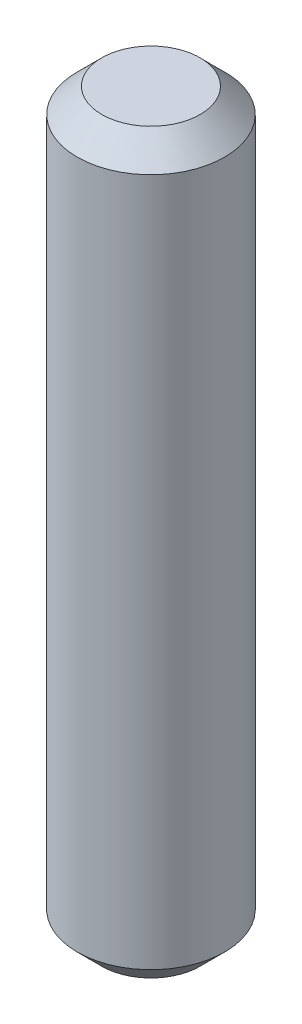
ISO-10303-21;
HEADER;
FILE_DESCRIPTION(('STEP AP214'),'2;1');
FILE_NAME('part.step','',(''),(''),'','','');
FILE_SCHEMA(('AUTOMOTIVE_DESIGN { 1 0 10303 214 1 1 1 1 }'));
ENDSEC;
DATA;
#1=APPLICATION_CONTEXT('core data for automotive mechanical design processes');
#2=APPLICATION_PROTOCOL_DEFINITION('international standard','automotive_design',2000,#1);
#3=PRODUCT_CONTEXT('',#1,'mechanical');
#4=PRODUCT('Part','Part','',(#3));
#5=PRODUCT_RELATED_PRODUCT_CATEGORY('part','',(#4));
#6=PRODUCT_DEFINITION_FORMATION('','',#4);
#7=PRODUCT_DEFINITION_CONTEXT('part definition',#1,'design');
#8=PRODUCT_DEFINITION('design','',#6,#7);
#9=PRODUCT_DEFINITION_SHAPE('','',#8);
#10=(LENGTH_UNIT() NAMED_UNIT(*) SI_UNIT(.MILLI.,.METRE.));
#11=(NAMED_UNIT(*) PLANE_ANGLE_UNIT() SI_UNIT($,.RADIAN.));
#12=(NAMED_UNIT(*) SI_UNIT($,.STERADIAN.) SOLID_ANGLE_UNIT());
#13=UNCERTAINTY_MEASURE_WITH_UNIT(LENGTH_MEASURE(1.E-05),#10,'distance_accuracy_value','');
#14=(GEOMETRIC_REPRESENTATION_CONTEXT(3) GLOBAL_UNCERTAINTY_ASSIGNED_CONTEXT((#13)) GLOBAL_UNIT_ASSIGNED_CONTEXT((#10,
#11,#12)) REPRESENTATION_CONTEXT('',''));
#15=CARTESIAN_POINT('',(0.,0.,0.));
#16=DIRECTION('',(0.,0.,1.));
#17=DIRECTION('',(1.,0.,0.));
#18=AXIS2_PLACEMENT_3D('',#15,#16,#17);
#19=CARTESIAN_POINT('',(0.,30.,0.));
#20=DIRECTION('',(0.,-1.,0.));
#21=DIRECTION('',(0.,0.,-1.));
#22=AXIS2_PLACEMENT_3D('',#19,#20,#21);
#23=CYLINDRICAL_SURFACE('',#22,3.);
#24=CARTESIAN_POINT('',(0.,0.999999999999997,0.));
#25=DIRECTION('',(0.,1.,0.));
#26=DIRECTION('',(0.,0.,1.));
#27=AXIS2_PLACEMENT_3D('',#24,#25,#26);
#28=CIRCLE('',#27,3.);
#29=CARTESIAN_POINT('',(0.,0.999999999999997,3.));
#30=VERTEX_POINT('',#29);
#31=EDGE_CURVE('E40',#30,#30,#28,.T.);
#32=ORIENTED_EDGE('',*,*,#31,.T.);
#33=EDGE_LOOP('',(#32));
#34=FACE_BOUND('',#33,.T.);
#35=CARTESIAN_POINT('',(0.,29.,0.));
#36=DIRECTION('',(0.,1.,0.));
#37=DIRECTION('',(0.,0.,1.));
#38=AXIS2_PLACEMENT_3D('',#35,#36,#37);
#39=CIRCLE('',#38,3.);
#40=CARTESIAN_POINT('',(0.,29.,3.));
#41=VERTEX_POINT('',#40);
#42=EDGE_CURVE('E44',#41,#41,#39,.F.);
#43=ORIENTED_EDGE('',*,*,#42,.T.);
#44=EDGE_LOOP('',(#43));
#45=FACE_BOUND('',#44,.T.);
#46=ADVANCED_FACE('F29',(#34,#45),#23,.T.);
#47=CARTESIAN_POINT('',(0.,30.,0.));
#48=DIRECTION('',(0.,1.,0.));
#49=DIRECTION('',(0.,0.,1.));
#50=AXIS2_PLACEMENT_3D('',#47,#48,#49);
#51=PLANE('',#50);
#52=CARTESIAN_POINT('',(0.,30.,0.));
#53=DIRECTION('',(0.,1.,0.));
#54=DIRECTION('',(0.,0.,1.));
#55=AXIS2_PLACEMENT_3D('',#52,#53,#54);
#56=CIRCLE('',#55,2.);
#57=CARTESIAN_POINT('',(0.,30.,2.));
#58=VERTEX_POINT('',#57);
#59=EDGE_CURVE('E10',#58,#58,#56,.T.);
#60=ORIENTED_EDGE('',*,*,#59,.T.);
#61=EDGE_LOOP('',(#60));
#62=FACE_BOUND('',#61,.T.);
#63=ADVANCED_FACE('F60',(#62),#51,.T.);
#64=CARTESIAN_POINT('',(0.,0.,0.));
#65=DIRECTION('',(0.,1.,0.));
#66=DIRECTION('',(0.,0.,1.));
#67=AXIS2_PLACEMENT_3D('',#64,#65,#66);
#68=PLANE('',#67);
#69=CARTESIAN_POINT('',(0.,0.,0.));
#70=DIRECTION('',(0.,1.,0.));
#71=DIRECTION('',(0.,0.,1.));
#72=AXIS2_PLACEMENT_3D('',#69,#70,#71);
#73=CIRCLE('',#72,2.);
#74=CARTESIAN_POINT('',(0.,0.,2.));
#75=VERTEX_POINT('',#74);
#76=EDGE_CURVE('E36',#75,#75,#73,.F.);
#77=ORIENTED_EDGE('',*,*,#76,.T.);
#78=EDGE_LOOP('',(#77));
#79=FACE_BOUND('',#78,.T.);
#80=ADVANCED_FACE('F57',(#79),#68,.F.);
#81=CARTESIAN_POINT('',(0.,0.999999999999997,0.));
#82=DIRECTION('',(0.,1.,0.));
#83=DIRECTION('',(0.,0.,1.));
#84=AXIS2_PLACEMENT_3D('',#81,#82,#83);
#85=CONICAL_SURFACE('',#84,3.,0.78539816339745);
#86=ORIENTED_EDGE('',*,*,#76,.F.);
#87=EDGE_LOOP('',(#86));
#88=FACE_BOUND('',#87,.T.);
#89=ORIENTED_EDGE('',*,*,#31,.F.);
#90=EDGE_LOOP('',(#89));
#91=FACE_BOUND('',#90,.T.);
#92=ADVANCED_FACE('F53',(#88,#91),#85,.T.);
#93=CARTESIAN_POINT('',(0.,30.,0.));
#94=DIRECTION('',(0.,-1.,0.));
#95=DIRECTION('',(0.,0.,-1.));
#96=AXIS2_PLACEMENT_3D('',#93,#94,#95);
#97=CONICAL_SURFACE('',#96,2.,0.785398163397444);
#98=ORIENTED_EDGE('',*,*,#42,.F.);
#99=EDGE_LOOP('',(#98));
#100=FACE_BOUND('',#99,.T.);
#101=ORIENTED_EDGE('',*,*,#59,.F.);
#102=EDGE_LOOP('',(#101));
#103=FACE_BOUND('',#102,.T.);
#104=ADVANCED_FACE('F31',(#100,#103),#97,.T.);
#105=CLOSED_SHELL('',(#46,#63,#80,#92,#104));
#106=MANIFOLD_SOLID_BREP('B2',#105);
#107=ADVANCED_BREP_SHAPE_REPRESENTATION('',(#18,#106),#14);
#108=SHAPE_DEFINITION_REPRESENTATION(#9,#107);
ENDSEC;
END-ISO-10303-21;
